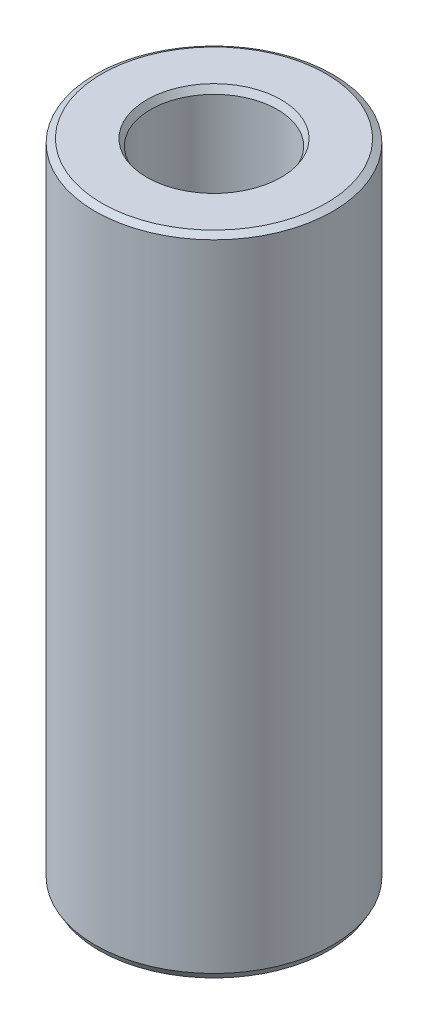
ISO-10303-21;
HEADER;
FILE_DESCRIPTION(('STEP AP214'),'2;1');
FILE_NAME('part.step','',(''),(''),'','','');
FILE_SCHEMA(('AUTOMOTIVE_DESIGN { 1 0 10303 214 1 1 1 1 }'));
ENDSEC;
DATA;
#1=APPLICATION_CONTEXT('core data for automotive mechanical design processes');
#2=APPLICATION_PROTOCOL_DEFINITION('international standard','automotive_design',2000,#1);
#3=PRODUCT_CONTEXT('',#1,'mechanical');
#4=PRODUCT('Part','Part','',(#3));
#5=PRODUCT_RELATED_PRODUCT_CATEGORY('part','',(#4));
#6=PRODUCT_DEFINITION_FORMATION('','',#4);
#7=PRODUCT_DEFINITION_CONTEXT('part definition',#1,'design');
#8=PRODUCT_DEFINITION('design','',#6,#7);
#9=PRODUCT_DEFINITION_SHAPE('','',#8);
#10=(LENGTH_UNIT() NAMED_UNIT(*) SI_UNIT(.MILLI.,.METRE.));
#11=(NAMED_UNIT(*) PLANE_ANGLE_UNIT() SI_UNIT($,.RADIAN.));
#12=(NAMED_UNIT(*) SI_UNIT($,.STERADIAN.) SOLID_ANGLE_UNIT());
#13=UNCERTAINTY_MEASURE_WITH_UNIT(LENGTH_MEASURE(1.E-05),#10,'distance_accuracy_value','');
#14=(GEOMETRIC_REPRESENTATION_CONTEXT(3) GLOBAL_UNCERTAINTY_ASSIGNED_CONTEXT((#13)) GLOBAL_UNIT_ASSIGNED_CONTEXT((#10,
#11,#12)) REPRESENTATION_CONTEXT('',''));
#15=CARTESIAN_POINT('',(0.,0.,0.));
#16=DIRECTION('',(0.,0.,1.));
#17=DIRECTION('',(1.,0.,0.));
#18=AXIS2_PLACEMENT_3D('',#15,#16,#17);
#19=CARTESIAN_POINT('',(0.,312.78909153652,0.));
#20=DIRECTION('',(0.,-1.,0.));
#21=DIRECTION('',(0.,0.,-1.));
#22=AXIS2_PLACEMENT_3D('',#19,#20,#21);
#23=CYLINDRICAL_SURFACE('',#22,57.5);
#24=CARTESIAN_POINT('',(0.,3.17999354882581,0.));
#25=DIRECTION('',(0.,1.,0.));
#26=DIRECTION('',(0.,0.,1.));
#27=AXIS2_PLACEMENT_3D('',#24,#25,#26);
#28=CIRCLE('',#27,57.5);
#29=CARTESIAN_POINT('',(0.,3.17999354882581,57.5));
#30=VERTEX_POINT('',#29);
#31=EDGE_CURVE('E10',#30,#30,#28,.T.);
#32=ORIENTED_EDGE('',*,*,#31,.T.);
#33=EDGE_LOOP('',(#32));
#34=FACE_BOUND('',#33,.T.);
#35=CARTESIAN_POINT('',(0.,310.943898366666,0.));
#36=DIRECTION('',(0.,1.,0.));
#37=DIRECTION('',(0.,0.,1.));
#38=AXIS2_PLACEMENT_3D('',#35,#36,#37);
#39=CIRCLE('',#38,57.5);
#40=CARTESIAN_POINT('',(0.,310.943898366666,57.5));
#41=VERTEX_POINT('',#40);
#42=EDGE_CURVE('E50',#41,#41,#39,.F.);
#43=ORIENTED_EDGE('',*,*,#42,.T.);
#44=EDGE_LOOP('',(#43));
#45=FACE_BOUND('',#44,.T.);
#46=ADVANCED_FACE('F39',(#34,#45),#23,.T.);
#47=CARTESIAN_POINT('',(0.,312.78909153652,0.));
#48=DIRECTION('',(0.,1.,0.));
#49=DIRECTION('',(0.,0.,1.));
#50=AXIS2_PLACEMENT_3D('',#47,#48,#49);
#51=PLANE('',#50);
#52=CARTESIAN_POINT('',(0.,312.78909153652,0.));
#53=DIRECTION('',(0.,1.,0.));
#54=DIRECTION('',(0.,0.,1.));
#55=AXIS2_PLACEMENT_3D('',#52,#53,#54);
#56=CIRCLE('',#55,32.5726617741633);
#57=CARTESIAN_POINT('',(0.,312.78909153652,32.5726617741633));
#58=VERTEX_POINT('',#57);
#59=EDGE_CURVE('E58',#58,#58,#56,.F.);
#60=ORIENTED_EDGE('',*,*,#59,.T.);
#61=EDGE_LOOP('',(#60));
#62=FACE_BOUND('',#61,.T.);
#63=CARTESIAN_POINT('',(0.,312.78909153652,0.));
#64=DIRECTION('',(0.,1.,0.));
#65=DIRECTION('',(0.,0.,1.));
#66=AXIS2_PLACEMENT_3D('',#63,#64,#65);
#67=CIRCLE('',#66,54.3200064511741);
#68=CARTESIAN_POINT('',(0.,312.78909153652,54.3200064511741));
#69=VERTEX_POINT('',#68);
#70=EDGE_CURVE('E61',#69,#69,#67,.T.);
#71=ORIENTED_EDGE('',*,*,#70,.T.);
#72=EDGE_LOOP('',(#71));
#73=FACE_BOUND('',#72,.T.);
#74=ADVANCED_FACE('F88',(#62,#73),#51,.T.);
#75=CARTESIAN_POINT('',(0.,0.,0.));
#76=DIRECTION('',(0.,1.,0.));
#77=DIRECTION('',(0.,0.,1.));
#78=AXIS2_PLACEMENT_3D('',#75,#76,#77);
#79=PLANE('',#78);
#80=CARTESIAN_POINT('',(0.,0.,0.));
#81=DIRECTION('',(0.,1.,0.));
#82=DIRECTION('',(0.,0.,1.));
#83=AXIS2_PLACEMENT_3D('',#80,#81,#82);
#84=CIRCLE('',#83,33.9074621531356);
#85=CARTESIAN_POINT('',(0.,0.,33.9074621531356));
#86=VERTEX_POINT('',#85);
#87=EDGE_CURVE('E51',#86,#86,#84,.T.);
#88=ORIENTED_EDGE('',*,*,#87,.T.);
#89=EDGE_LOOP('',(#88));
#90=FACE_BOUND('',#89,.T.);
#91=CARTESIAN_POINT('',(0.,0.,0.));
#92=DIRECTION('',(0.,1.,0.));
#93=DIRECTION('',(0.,0.,1.));
#94=AXIS2_PLACEMENT_3D('',#91,#92,#93);
#95=CIRCLE('',#94,55.6548068301464);
#96=CARTESIAN_POINT('',(0.,0.,55.6548068301464));
#97=VERTEX_POINT('',#96);
#98=EDGE_CURVE('E54',#97,#97,#95,.F.);
#99=ORIENTED_EDGE('',*,*,#98,.T.);
#100=EDGE_LOOP('',(#99));
#101=FACE_BOUND('',#100,.T.);
#102=ADVANCED_FACE('F83',(#90,#101),#79,.F.);
#103=CARTESIAN_POINT('',(0.,312.78909153652,0.));
#104=DIRECTION('',(0.,-1.,0.));
#105=DIRECTION('',(0.,0.,-1.));
#106=AXIS2_PLACEMENT_3D('',#103,#104,#105);
#107=CYLINDRICAL_SURFACE('',#106,30.7274686043096);
#108=CARTESIAN_POINT('',(0.,309.609097987694,0.));
#109=DIRECTION('',(0.,1.,0.));
#110=DIRECTION('',(0.,0.,1.));
#111=AXIS2_PLACEMENT_3D('',#108,#109,#110);
#112=CIRCLE('',#111,30.7274686043096);
#113=CARTESIAN_POINT('',(0.,309.609097987694,30.7274686043096));
#114=VERTEX_POINT('',#113);
#115=EDGE_CURVE('E67',#114,#114,#112,.T.);
#116=ORIENTED_EDGE('',*,*,#115,.T.);
#117=EDGE_LOOP('',(#116));
#118=FACE_BOUND('',#117,.T.);
#119=CARTESIAN_POINT('',(0.,1.84519316985371,0.));
#120=DIRECTION('',(0.,1.,0.));
#121=DIRECTION('',(0.,0.,1.));
#122=AXIS2_PLACEMENT_3D('',#119,#120,#121);
#123=CIRCLE('',#122,30.7274686043096);
#124=CARTESIAN_POINT('',(0.,1.84519316985371,30.7274686043096));
#125=VERTEX_POINT('',#124);
#126=EDGE_CURVE('E69',#125,#125,#123,.F.);
#127=ORIENTED_EDGE('',*,*,#126,.T.);
#128=EDGE_LOOP('',(#127));
#129=FACE_BOUND('',#128,.T.);
#130=ADVANCED_FACE('F71',(#118,#129),#107,.F.);
#131=CARTESIAN_POINT('',(0.,309.609097987694,0.));
#132=DIRECTION('',(0.,1.,0.));
#133=DIRECTION('',(0.,0.,1.));
#134=AXIS2_PLACEMENT_3D('',#131,#132,#133);
#135=CONICAL_SURFACE('',#134,30.7274686043096,0.525771293075794);
#136=ORIENTED_EDGE('',*,*,#59,.F.);
#137=EDGE_LOOP('',(#136));
#138=FACE_BOUND('',#137,.T.);
#139=ORIENTED_EDGE('',*,*,#115,.F.);
#140=EDGE_LOOP('',(#139));
#141=FACE_BOUND('',#140,.T.);
#142=ADVANCED_FACE('F77',(#138,#141),#135,.F.);
#143=CARTESIAN_POINT('',(0.,0.,0.));
#144=DIRECTION('',(0.,-1.,0.));
#145=DIRECTION('',(0.,0.,-1.));
#146=AXIS2_PLACEMENT_3D('',#143,#144,#145);
#147=CONICAL_SURFACE('',#146,33.9074621531356,1.0450250337191);
#148=ORIENTED_EDGE('',*,*,#126,.F.);
#149=EDGE_LOOP('',(#148));
#150=FACE_BOUND('',#149,.T.);
#151=ORIENTED_EDGE('',*,*,#87,.F.);
#152=EDGE_LOOP('',(#151));
#153=FACE_BOUND('',#152,.T.);
#154=ADVANCED_FACE('F73',(#150,#153),#147,.F.);
#155=CARTESIAN_POINT('',(0.,3.17999354882581,0.));
#156=DIRECTION('',(0.,1.,0.));
#157=DIRECTION('',(0.,0.,1.));
#158=AXIS2_PLACEMENT_3D('',#155,#156,#157);
#159=CONICAL_SURFACE('',#158,57.5,0.525771293075801);
#160=ORIENTED_EDGE('',*,*,#98,.F.);
#161=EDGE_LOOP('',(#160));
#162=FACE_BOUND('',#161,.T.);
#163=ORIENTED_EDGE('',*,*,#31,.F.);
#164=EDGE_LOOP('',(#163));
#165=FACE_BOUND('',#164,.T.);
#166=ADVANCED_FACE('F76',(#162,#165),#159,.T.);
#167=CARTESIAN_POINT('',(0.,312.78909153652,0.));
#168=DIRECTION('',(0.,-1.,0.));
#169=DIRECTION('',(0.,0.,-1.));
#170=AXIS2_PLACEMENT_3D('',#167,#168,#169);
#171=CONICAL_SURFACE('',#170,54.3200064511741,1.04502503371909);
#172=ORIENTED_EDGE('',*,*,#42,.F.);
#173=EDGE_LOOP('',(#172));
#174=FACE_BOUND('',#173,.T.);
#175=ORIENTED_EDGE('',*,*,#70,.F.);
#176=EDGE_LOOP('',(#175));
#177=FACE_BOUND('',#176,.T.);
#178=ADVANCED_FACE('F45',(#174,#177),#171,.T.);
#179=CLOSED_SHELL('',(#46,#74,#102,#130,#142,#154,#166,#178));
#180=MANIFOLD_SOLID_BREP('B2',#179);
#181=ADVANCED_BREP_SHAPE_REPRESENTATION('',(#18,#180),#14);
#182=SHAPE_DEFINITION_REPRESENTATION(#9,#181);
ENDSEC;
END-ISO-10303-21;
